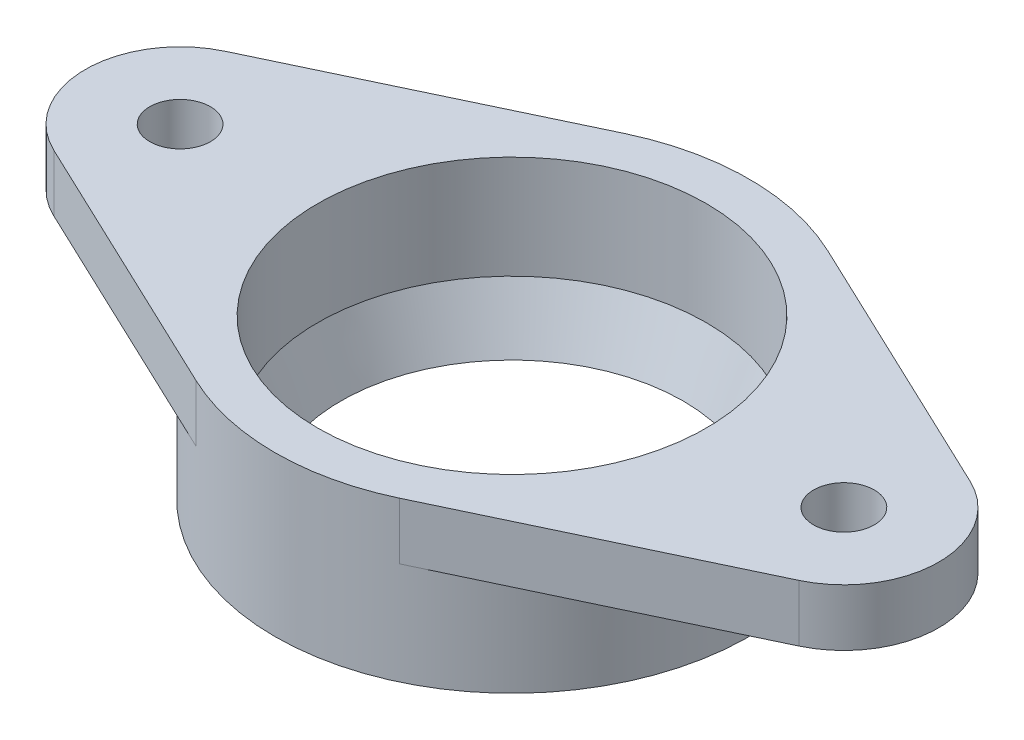
ISO-10303-21;
HEADER;
FILE_DESCRIPTION(('STEP AP214'),'2;1');
FILE_NAME('part.step','',(''),(''),'','','');
FILE_SCHEMA(('AUTOMOTIVE_DESIGN { 1 0 10303 214 1 1 1 1 }'));
ENDSEC;
DATA;
#1=APPLICATION_CONTEXT('core data for automotive mechanical design processes');
#2=APPLICATION_PROTOCOL_DEFINITION('international standard','automotive_design',2000,#1);
#3=PRODUCT_CONTEXT('',#1,'mechanical');
#4=PRODUCT('Part','Part','',(#3));
#5=PRODUCT_RELATED_PRODUCT_CATEGORY('part','',(#4));
#6=PRODUCT_DEFINITION_FORMATION('','',#4);
#7=PRODUCT_DEFINITION_CONTEXT('part definition',#1,'design');
#8=PRODUCT_DEFINITION('design','',#6,#7);
#9=PRODUCT_DEFINITION_SHAPE('','',#8);
#10=(LENGTH_UNIT() NAMED_UNIT(*) SI_UNIT(.MILLI.,.METRE.));
#11=(NAMED_UNIT(*) PLANE_ANGLE_UNIT() SI_UNIT($,.RADIAN.));
#12=(NAMED_UNIT(*) SI_UNIT($,.STERADIAN.) SOLID_ANGLE_UNIT());
#13=UNCERTAINTY_MEASURE_WITH_UNIT(LENGTH_MEASURE(1.E-05),#10,'distance_accuracy_value','');
#14=(GEOMETRIC_REPRESENTATION_CONTEXT(3) GLOBAL_UNCERTAINTY_ASSIGNED_CONTEXT((#13)) GLOBAL_UNIT_ASSIGNED_CONTEXT((#10,
#11,#12)) REPRESENTATION_CONTEXT('',''));
#15=CARTESIAN_POINT('',(0.,0.,0.));
#16=DIRECTION('',(0.,0.,1.));
#17=DIRECTION('',(1.,0.,0.));
#18=AXIS2_PLACEMENT_3D('',#15,#16,#17);
#19=CARTESIAN_POINT('',(0.,-8.4,0.));
#20=DIRECTION('',(0.,1.,0.));
#21=DIRECTION('',(0.,0.,1.));
#22=AXIS2_PLACEMENT_3D('',#19,#20,#21);
#23=CYLINDRICAL_SURFACE('',#22,12.5);
#24=CARTESIAN_POINT('',(0.,-8.4,0.));
#25=DIRECTION('',(0.,1.,0.));
#26=DIRECTION('',(0.,0.,1.));
#27=AXIS2_PLACEMENT_3D('',#24,#25,#26);
#28=CIRCLE('',#27,12.5);
#29=CARTESIAN_POINT('',(0.,-8.4,12.5));
#30=VERTEX_POINT('',#29);
#31=EDGE_CURVE('E11',#30,#30,#28,.T.);
#32=ORIENTED_EDGE('',*,*,#31,.T.);
#33=EDGE_LOOP('',(#32));
#34=FACE_BOUND('',#33,.T.);
#35=CARTESIAN_POINT('',(0.,0.,0.));
#36=DIRECTION('',(0.,1.,0.));
#37=DIRECTION('',(0.,0.,1.));
#38=AXIS2_PLACEMENT_3D('',#35,#36,#37);
#39=CIRCLE('',#38,12.5);
#40=CARTESIAN_POINT('',(5.35714285714285,0.,-11.2938487863156));
#41=VERTEX_POINT('',#40);
#42=CARTESIAN_POINT('',(-5.35714285714285,0.,-11.2938487863156));
#43=VERTEX_POINT('',#42);
#44=EDGE_CURVE('E184',#41,#43,#39,.T.);
#45=ORIENTED_EDGE('',*,*,#44,.F.);
#46=DIRECTION('',(0.,1.,0.));
#47=VECTOR('',#46,1.);
#48=CARTESIAN_POINT('',(5.35714285714285,-3.,-11.2938487863156));
#49=LINE('',#48,#47);
#50=CARTESIAN_POINT('',(5.35714285714285,-3.,-11.2938487863156));
#51=VERTEX_POINT('',#50);
#52=EDGE_CURVE('E129',#51,#41,#49,.T.);
#53=ORIENTED_EDGE('',*,*,#52,.F.);
#54=CARTESIAN_POINT('',(0.,-3.,0.));
#55=DIRECTION('',(0.,-1.,0.));
#56=DIRECTION('',(0.,0.,1.));
#57=AXIS2_PLACEMENT_3D('',#54,#55,#56);
#58=CIRCLE('',#57,12.5);
#59=CARTESIAN_POINT('',(5.35714285714285,-3.,11.2938487863156));
#60=VERTEX_POINT('',#59);
#61=EDGE_CURVE('E122',#51,#60,#58,.T.);
#62=ORIENTED_EDGE('',*,*,#61,.T.);
#63=DIRECTION('',(0.,1.,0.));
#64=VECTOR('',#63,1.);
#65=CARTESIAN_POINT('',(5.35714285714285,-3.,11.2938487863156));
#66=LINE('',#65,#64);
#67=CARTESIAN_POINT('',(5.35714285714285,0.,11.2938487863156));
#68=VERTEX_POINT('',#67);
#69=EDGE_CURVE('E106',#60,#68,#66,.T.);
#70=ORIENTED_EDGE('',*,*,#69,.T.);
#71=CARTESIAN_POINT('',(-5.35714285714285,0.,11.2938487863156));
#72=VERTEX_POINT('',#71);
#73=EDGE_CURVE('E46',#72,#68,#39,.T.);
#74=ORIENTED_EDGE('',*,*,#73,.F.);
#75=DIRECTION('',(0.,1.,0.));
#76=VECTOR('',#75,1.);
#77=CARTESIAN_POINT('',(-5.35714285714285,-3.,11.2938487863156));
#78=LINE('',#77,#76);
#79=CARTESIAN_POINT('',(-5.35714285714285,-3.,11.2938487863156));
#80=VERTEX_POINT('',#79);
#81=EDGE_CURVE('E171',#80,#72,#78,.T.);
#82=ORIENTED_EDGE('',*,*,#81,.F.);
#83=CARTESIAN_POINT('',(0.,-3.,0.));
#84=DIRECTION('',(0.,-1.,0.));
#85=DIRECTION('',(0.,0.,1.));
#86=AXIS2_PLACEMENT_3D('',#83,#84,#85);
#87=CIRCLE('',#86,12.5);
#88=CARTESIAN_POINT('',(-5.35714285714285,-3.,-11.2938487863156));
#89=VERTEX_POINT('',#88);
#90=EDGE_CURVE('E153',#80,#89,#87,.T.);
#91=ORIENTED_EDGE('',*,*,#90,.T.);
#92=DIRECTION('',(0.,1.,0.));
#93=VECTOR('',#92,1.);
#94=CARTESIAN_POINT('',(-5.35714285714285,-3.,-11.2938487863156));
#95=LINE('',#94,#93);
#96=EDGE_CURVE('E165',#89,#43,#95,.T.);
#97=ORIENTED_EDGE('',*,*,#96,.T.);
#98=EDGE_LOOP('',(#45,#53,#62,#70,#74,#82,#91,#97));
#99=FACE_BOUND('',#98,.T.);
#100=ADVANCED_FACE('F38',(#34,#99),#23,.T.);
#101=CARTESIAN_POINT('',(0.,-8.4,0.));
#102=DIRECTION('',(0.,1.,0.));
#103=DIRECTION('',(0.,0.,1.));
#104=AXIS2_PLACEMENT_3D('',#101,#102,#103);
#105=PLANE('',#104);
#106=ORIENTED_EDGE('',*,*,#31,.F.);
#107=EDGE_LOOP('',(#106));
#108=FACE_BOUND('',#107,.T.);
#109=CARTESIAN_POINT('',(0.,-8.4,0.));
#110=DIRECTION('',(0.,-1.,0.));
#111=DIRECTION('',(0.,0.,-1.));
#112=AXIS2_PLACEMENT_3D('',#109,#110,#111);
#113=CIRCLE('',#112,9.02387175054684);
#114=CARTESIAN_POINT('',(0.,-8.4,-9.02387175054684));
#115=VERTEX_POINT('',#114);
#116=EDGE_CURVE('E173',#115,#115,#113,.T.);
#117=ORIENTED_EDGE('',*,*,#116,.F.);
#118=EDGE_LOOP('',(#117));
#119=FACE_BOUND('',#118,.T.);
#120=ADVANCED_FACE('F211',(#108,#119),#105,.F.);
#121=CARTESIAN_POINT('',(0.,0.,0.));
#122=DIRECTION('',(0.,1.,0.));
#123=DIRECTION('',(0.,0.,1.));
#124=AXIS2_PLACEMENT_3D('',#121,#122,#123);
#125=PLANE('',#124);
#126=CARTESIAN_POINT('',(0.,0.,0.));
#127=DIRECTION('',(0.,-1.,0.));
#128=DIRECTION('',(0.,0.,-1.));
#129=AXIS2_PLACEMENT_3D('',#126,#127,#128);
#130=CIRCLE('',#129,10.25);
#131=CARTESIAN_POINT('',(0.,0.,-10.25));
#132=VERTEX_POINT('',#131);
#133=EDGE_CURVE('E182',#132,#132,#130,.T.);
#134=ORIENTED_EDGE('',*,*,#133,.T.);
#135=EDGE_LOOP('',(#134));
#136=FACE_BOUND('',#135,.T.);
#137=ORIENTED_EDGE('',*,*,#73,.T.);
#138=DIRECTION('',(0.903507902905252,0.,-0.428571428571428));
#139=VECTOR('',#138,1.);
#140=CARTESIAN_POINT('',(5.35714285714285,0.,11.2938487863156));
#141=LINE('',#140,#139);
#142=CARTESIAN_POINT('',(19.6428571428571,0.,4.51753951452626));
#143=VERTEX_POINT('',#142);
#144=EDGE_CURVE('E111',#68,#143,#141,.T.);
#145=ORIENTED_EDGE('',*,*,#144,.T.);
#146=CARTESIAN_POINT('',(17.5,0.,0.));
#147=DIRECTION('',(0.,1.,0.));
#148=DIRECTION('',(0.,0.,-1.));
#149=AXIS2_PLACEMENT_3D('',#146,#147,#148);
#150=CIRCLE('',#149,5.);
#151=CARTESIAN_POINT('',(19.6428571428571,0.,-4.51753951452626));
#152=VERTEX_POINT('',#151);
#153=EDGE_CURVE('E131',#143,#152,#150,.T.);
#154=ORIENTED_EDGE('',*,*,#153,.T.);
#155=DIRECTION('',(-0.903507902905252,0.,-0.428571428571428));
#156=VECTOR('',#155,1.);
#157=CARTESIAN_POINT('',(5.35714285714285,0.,-11.2938487863156));
#158=LINE('',#157,#156);
#159=EDGE_CURVE('E54',#152,#41,#158,.T.);
#160=ORIENTED_EDGE('',*,*,#159,.T.);
#161=ORIENTED_EDGE('',*,*,#44,.T.);
#162=DIRECTION('',(-0.903507902905252,0.,0.428571428571428));
#163=VECTOR('',#162,1.);
#164=CARTESIAN_POINT('',(-5.35714285714285,0.,-11.2938487863156));
#165=LINE('',#164,#163);
#166=CARTESIAN_POINT('',(-19.6428571428571,0.,-4.51753951452626));
#167=VERTEX_POINT('',#166);
#168=EDGE_CURVE('E150',#43,#167,#165,.T.);
#169=ORIENTED_EDGE('',*,*,#168,.T.);
#170=CARTESIAN_POINT('',(-17.5,0.,0.));
#171=DIRECTION('',(0.,1.,0.));
#172=DIRECTION('',(0.,0.,1.));
#173=AXIS2_PLACEMENT_3D('',#170,#171,#172);
#174=CIRCLE('',#173,5.);
#175=CARTESIAN_POINT('',(-19.6428571428571,0.,4.51753951452626));
#176=VERTEX_POINT('',#175);
#177=EDGE_CURVE('E168',#167,#176,#174,.T.);
#178=ORIENTED_EDGE('',*,*,#177,.T.);
#179=DIRECTION('',(0.903507902905252,0.,0.428571428571428));
#180=VECTOR('',#179,1.);
#181=CARTESIAN_POINT('',(-5.35714285714285,0.,11.2938487863156));
#182=LINE('',#181,#180);
#183=EDGE_CURVE('E61',#176,#72,#182,.T.);
#184=ORIENTED_EDGE('',*,*,#183,.T.);
#185=EDGE_LOOP('',(#137,#145,#154,#160,#161,#169,#178,#184));
#186=FACE_BOUND('',#185,.T.);
#187=CARTESIAN_POINT('',(-17.5,0.,0.));
#188=DIRECTION('',(0.,1.,0.));
#189=DIRECTION('',(0.,0.,1.));
#190=AXIS2_PLACEMENT_3D('',#187,#188,#189);
#191=CIRCLE('',#190,1.6);
#192=CARTESIAN_POINT('',(-17.5,0.,1.6));
#193=VERTEX_POINT('',#192);
#194=EDGE_CURVE('E143',#193,#193,#191,.T.);
#195=ORIENTED_EDGE('',*,*,#194,.F.);
#196=EDGE_LOOP('',(#195));
#197=FACE_BOUND('',#196,.T.);
#198=CARTESIAN_POINT('',(17.5,0.,0.));
#199=DIRECTION('',(0.,1.,0.));
#200=DIRECTION('',(0.,0.,-1.));
#201=AXIS2_PLACEMENT_3D('',#198,#199,#200);
#202=CIRCLE('',#201,1.6);
#203=CARTESIAN_POINT('',(17.5,0.,-1.6));
#204=VERTEX_POINT('',#203);
#205=EDGE_CURVE('E134',#204,#204,#202,.T.);
#206=ORIENTED_EDGE('',*,*,#205,.F.);
#207=EDGE_LOOP('',(#206));
#208=FACE_BOUND('',#207,.T.);
#209=ADVANCED_FACE('F186',(#136,#186,#197,#208),#125,.T.);
#210=CARTESIAN_POINT('',(0.,0.,0.));
#211=DIRECTION('',(0.,-1.,0.));
#212=DIRECTION('',(0.,0.,-1.));
#213=AXIS2_PLACEMENT_3D('',#210,#211,#212);
#214=CYLINDRICAL_SURFACE('',#213,10.25);
#215=CARTESIAN_POINT('',(0.,-5.43708362974617,0.));
#216=DIRECTION('',(0.,1.,0.));
#217=DIRECTION('',(0.,0.,1.));
#218=AXIS2_PLACEMENT_3D('',#215,#216,#217);
#219=CIRCLE('',#218,10.25);
#220=CARTESIAN_POINT('',(0.,-5.43708362974617,10.25));
#221=VERTEX_POINT('',#220);
#222=EDGE_CURVE('E41',#221,#221,#219,.F.);
#223=ORIENTED_EDGE('',*,*,#222,.T.);
#224=EDGE_LOOP('',(#223));
#225=FACE_BOUND('',#224,.T.);
#226=ORIENTED_EDGE('',*,*,#133,.F.);
#227=EDGE_LOOP('',(#226));
#228=FACE_BOUND('',#227,.T.);
#229=ADVANCED_FACE('F224',(#225,#228),#214,.F.);
#230=CARTESIAN_POINT('',(0.,0.,0.));
#231=DIRECTION('',(0.,1.,0.));
#232=DIRECTION('',(0.,0.,1.));
#233=AXIS2_PLACEMENT_3D('',#230,#231,#232);
#234=CONICAL_SURFACE('',#233,12.5,0.392367199483089);
#235=ORIENTED_EDGE('',*,*,#116,.T.);
#236=EDGE_LOOP('',(#235));
#237=FACE_BOUND('',#236,.T.);
#238=ORIENTED_EDGE('',*,*,#222,.F.);
#239=EDGE_LOOP('',(#238));
#240=FACE_BOUND('',#239,.T.);
#241=ADVANCED_FACE('F208',(#237,#240),#234,.F.);
#242=CARTESIAN_POINT('',(-5.35714285714285,-3.,11.2938487863156));
#243=DIRECTION('',(-0.428571428571428,0.,0.903507902905251));
#244=DIRECTION('',(0.903507902905251,0.,0.428571428571428));
#245=AXIS2_PLACEMENT_3D('',#242,#243,#244);
#246=PLANE('',#245);
#247=ORIENTED_EDGE('',*,*,#183,.F.);
#248=DIRECTION('',(0.,1.,0.));
#249=VECTOR('',#248,1.);
#250=CARTESIAN_POINT('',(-19.6428571428571,-3.,4.51753951452626));
#251=LINE('',#250,#249);
#252=CARTESIAN_POINT('',(-19.6428571428571,-3.,4.51753951452626));
#253=VERTEX_POINT('',#252);
#254=EDGE_CURVE('E174',#253,#176,#251,.T.);
#255=ORIENTED_EDGE('',*,*,#254,.F.);
#256=DIRECTION('',(0.903507902905252,0.,0.428571428571428));
#257=VECTOR('',#256,1.);
#258=CARTESIAN_POINT('',(-5.35714285714285,-3.,11.2938487863156));
#259=LINE('',#258,#257);
#260=EDGE_CURVE('E162',#253,#80,#259,.T.);
#261=ORIENTED_EDGE('',*,*,#260,.T.);
#262=ORIENTED_EDGE('',*,*,#81,.T.);
#263=EDGE_LOOP('',(#247,#255,#261,#262));
#264=FACE_BOUND('',#263,.T.);
#265=ADVANCED_FACE('F198',(#264),#246,.T.);
#266=CARTESIAN_POINT('',(-17.5,-3.,0.));
#267=DIRECTION('',(0.,1.,0.));
#268=DIRECTION('',(0.,0.,1.));
#269=AXIS2_PLACEMENT_3D('',#266,#267,#268);
#270=CYLINDRICAL_SURFACE('',#269,5.);
#271=ORIENTED_EDGE('',*,*,#177,.F.);
#272=DIRECTION('',(0.,1.,0.));
#273=VECTOR('',#272,1.);
#274=CARTESIAN_POINT('',(-19.6428571428571,-3.,-4.51753951452626));
#275=LINE('',#274,#273);
#276=CARTESIAN_POINT('',(-19.6428571428571,-3.,-4.51753951452626));
#277=VERTEX_POINT('',#276);
#278=EDGE_CURVE('E176',#277,#167,#275,.T.);
#279=ORIENTED_EDGE('',*,*,#278,.F.);
#280=CARTESIAN_POINT('',(-17.5,-3.,0.));
#281=DIRECTION('',(0.,1.,0.));
#282=DIRECTION('',(0.,0.,1.));
#283=AXIS2_PLACEMENT_3D('',#280,#281,#282);
#284=CIRCLE('',#283,5.);
#285=EDGE_CURVE('E159',#277,#253,#284,.T.);
#286=ORIENTED_EDGE('',*,*,#285,.T.);
#287=ORIENTED_EDGE('',*,*,#254,.T.);
#288=EDGE_LOOP('',(#271,#279,#286,#287));
#289=FACE_BOUND('',#288,.T.);
#290=ADVANCED_FACE('F200',(#289),#270,.T.);
#291=CARTESIAN_POINT('',(-5.35714285714285,-3.,-11.2938487863156));
#292=DIRECTION('',(-0.428571428571428,0.,-0.903507902905251));
#293=DIRECTION('',(-0.903507902905251,0.,0.428571428571428));
#294=AXIS2_PLACEMENT_3D('',#291,#292,#293);
#295=PLANE('',#294);
#296=ORIENTED_EDGE('',*,*,#168,.F.);
#297=ORIENTED_EDGE('',*,*,#96,.F.);
#298=DIRECTION('',(-0.903507902905252,0.,0.428571428571428));
#299=VECTOR('',#298,1.);
#300=CARTESIAN_POINT('',(-5.35714285714285,-3.,-11.2938487863156));
#301=LINE('',#300,#299);
#302=EDGE_CURVE('E156',#89,#277,#301,.T.);
#303=ORIENTED_EDGE('',*,*,#302,.T.);
#304=ORIENTED_EDGE('',*,*,#278,.T.);
#305=EDGE_LOOP('',(#296,#297,#303,#304));
#306=FACE_BOUND('',#305,.T.);
#307=ADVANCED_FACE('F189',(#306),#295,.T.);
#308=CARTESIAN_POINT('',(0.,-3.,0.));
#309=DIRECTION('',(0.,1.,0.));
#310=DIRECTION('',(0.,0.,1.));
#311=AXIS2_PLACEMENT_3D('',#308,#309,#310);
#312=PLANE('',#311);
#313=CARTESIAN_POINT('',(-17.5,-3.,0.));
#314=DIRECTION('',(0.,1.,0.));
#315=DIRECTION('',(0.,0.,1.));
#316=AXIS2_PLACEMENT_3D('',#313,#314,#315);
#317=CIRCLE('',#316,1.6);
#318=CARTESIAN_POINT('',(-17.5,-3.,1.6));
#319=VERTEX_POINT('',#318);
#320=EDGE_CURVE('E147',#319,#319,#317,.T.);
#321=ORIENTED_EDGE('',*,*,#320,.T.);
#322=EDGE_LOOP('',(#321));
#323=FACE_BOUND('',#322,.T.);
#324=ORIENTED_EDGE('',*,*,#90,.F.);
#325=ORIENTED_EDGE('',*,*,#260,.F.);
#326=ORIENTED_EDGE('',*,*,#285,.F.);
#327=ORIENTED_EDGE('',*,*,#302,.F.);
#328=EDGE_LOOP('',(#324,#325,#326,#327));
#329=FACE_BOUND('',#328,.T.);
#330=ADVANCED_FACE('F195',(#323,#329),#312,.F.);
#331=CARTESIAN_POINT('',(-17.5,-3.,0.));
#332=DIRECTION('',(0.,1.,0.));
#333=DIRECTION('',(0.,0.,1.));
#334=AXIS2_PLACEMENT_3D('',#331,#332,#333);
#335=CYLINDRICAL_SURFACE('',#334,1.6);
#336=ORIENTED_EDGE('',*,*,#320,.F.);
#337=EDGE_LOOP('',(#336));
#338=FACE_BOUND('',#337,.T.);
#339=ORIENTED_EDGE('',*,*,#194,.T.);
#340=EDGE_LOOP('',(#339));
#341=FACE_BOUND('',#340,.T.);
#342=ADVANCED_FACE('F270',(#338,#341),#335,.F.);
#343=CARTESIAN_POINT('',(5.35714285714285,-3.,-11.2938487863156));
#344=DIRECTION('',(0.428571428571428,0.,-0.903507902905251));
#345=DIRECTION('',(-0.903507902905251,0.,-0.428571428571428));
#346=AXIS2_PLACEMENT_3D('',#343,#344,#345);
#347=PLANE('',#346);
#348=ORIENTED_EDGE('',*,*,#159,.F.);
#349=DIRECTION('',(0.,1.,0.));
#350=VECTOR('',#349,1.);
#351=CARTESIAN_POINT('',(19.6428571428571,-3.,-4.51753951452626));
#352=LINE('',#351,#350);
#353=CARTESIAN_POINT('',(19.6428571428571,-3.,-4.51753951452626));
#354=VERTEX_POINT('',#353);
#355=EDGE_CURVE('E144',#354,#152,#352,.T.);
#356=ORIENTED_EDGE('',*,*,#355,.F.);
#357=DIRECTION('',(-0.903507902905252,0.,-0.428571428571428));
#358=VECTOR('',#357,1.);
#359=CARTESIAN_POINT('',(5.35714285714285,-3.,-11.2938487863156));
#360=LINE('',#359,#358);
#361=EDGE_CURVE('E116',#354,#51,#360,.T.);
#362=ORIENTED_EDGE('',*,*,#361,.T.);
#363=ORIENTED_EDGE('',*,*,#52,.T.);
#364=EDGE_LOOP('',(#348,#356,#362,#363));
#365=FACE_BOUND('',#364,.T.);
#366=ADVANCED_FACE('F280',(#365),#347,.T.);
#367=CARTESIAN_POINT('',(17.5,-3.,0.));
#368=DIRECTION('',(0.,1.,0.));
#369=DIRECTION('',(0.,0.,1.));
#370=AXIS2_PLACEMENT_3D('',#367,#368,#369);
#371=CYLINDRICAL_SURFACE('',#370,5.);
#372=ORIENTED_EDGE('',*,*,#153,.F.);
#373=DIRECTION('',(0.,1.,0.));
#374=VECTOR('',#373,1.);
#375=CARTESIAN_POINT('',(19.6428571428571,-3.,4.51753951452626));
#376=LINE('',#375,#374);
#377=CARTESIAN_POINT('',(19.6428571428571,-3.,4.51753951452626));
#378=VERTEX_POINT('',#377);
#379=EDGE_CURVE('E115',#378,#143,#376,.T.);
#380=ORIENTED_EDGE('',*,*,#379,.F.);
#381=CARTESIAN_POINT('',(17.5,-3.,0.));
#382=DIRECTION('',(0.,1.,0.));
#383=DIRECTION('',(0.,0.,-1.));
#384=AXIS2_PLACEMENT_3D('',#381,#382,#383);
#385=CIRCLE('',#384,5.);
#386=EDGE_CURVE('E125',#378,#354,#385,.T.);
#387=ORIENTED_EDGE('',*,*,#386,.T.);
#388=ORIENTED_EDGE('',*,*,#355,.T.);
#389=EDGE_LOOP('',(#372,#380,#387,#388));
#390=FACE_BOUND('',#389,.T.);
#391=ADVANCED_FACE('F290',(#390),#371,.T.);
#392=CARTESIAN_POINT('',(5.35714285714285,-3.,11.2938487863156));
#393=DIRECTION('',(0.428571428571428,0.,0.903507902905251));
#394=DIRECTION('',(0.903507902905251,0.,-0.428571428571428));
#395=AXIS2_PLACEMENT_3D('',#392,#393,#394);
#396=PLANE('',#395);
#397=ORIENTED_EDGE('',*,*,#144,.F.);
#398=ORIENTED_EDGE('',*,*,#69,.F.);
#399=DIRECTION('',(0.903507902905252,0.,-0.428571428571428));
#400=VECTOR('',#399,1.);
#401=CARTESIAN_POINT('',(5.35714285714285,-3.,11.2938487863156));
#402=LINE('',#401,#400);
#403=EDGE_CURVE('E109',#60,#378,#402,.T.);
#404=ORIENTED_EDGE('',*,*,#403,.T.);
#405=ORIENTED_EDGE('',*,*,#379,.T.);
#406=EDGE_LOOP('',(#397,#398,#404,#405));
#407=FACE_BOUND('',#406,.T.);
#408=ADVANCED_FACE('F108',(#407),#396,.T.);
#409=CARTESIAN_POINT('',(0.,-3.,0.));
#410=DIRECTION('',(0.,1.,0.));
#411=DIRECTION('',(0.,0.,1.));
#412=AXIS2_PLACEMENT_3D('',#409,#410,#411);
#413=PLANE('',#412);
#414=CARTESIAN_POINT('',(17.5,-3.,0.));
#415=DIRECTION('',(0.,1.,0.));
#416=DIRECTION('',(0.,0.,-1.));
#417=AXIS2_PLACEMENT_3D('',#414,#415,#416);
#418=CIRCLE('',#417,1.6);
#419=CARTESIAN_POINT('',(17.5,-3.,-1.6));
#420=VERTEX_POINT('',#419);
#421=EDGE_CURVE('E140',#420,#420,#418,.T.);
#422=ORIENTED_EDGE('',*,*,#421,.T.);
#423=EDGE_LOOP('',(#422));
#424=FACE_BOUND('',#423,.T.);
#425=ORIENTED_EDGE('',*,*,#61,.F.);
#426=ORIENTED_EDGE('',*,*,#361,.F.);
#427=ORIENTED_EDGE('',*,*,#386,.F.);
#428=ORIENTED_EDGE('',*,*,#403,.F.);
#429=EDGE_LOOP('',(#425,#426,#427,#428));
#430=FACE_BOUND('',#429,.T.);
#431=ADVANCED_FACE('F120',(#424,#430),#413,.F.);
#432=CARTESIAN_POINT('',(17.5,-3.,0.));
#433=DIRECTION('',(0.,1.,0.));
#434=DIRECTION('',(0.,0.,1.));
#435=AXIS2_PLACEMENT_3D('',#432,#433,#434);
#436=CYLINDRICAL_SURFACE('',#435,1.6);
#437=ORIENTED_EDGE('',*,*,#421,.F.);
#438=EDGE_LOOP('',(#437));
#439=FACE_BOUND('',#438,.T.);
#440=ORIENTED_EDGE('',*,*,#205,.T.);
#441=EDGE_LOOP('',(#440));
#442=FACE_BOUND('',#441,.T.);
#443=ADVANCED_FACE('F317',(#439,#442),#436,.F.);
#444=CLOSED_SHELL('',(#100,#120,#209,#229,#241,#265,#290,#307,#330,#342,#366,#391,#408,#431,#443));
#445=MANIFOLD_SOLID_BREP('B2',#444);
#446=ADVANCED_BREP_SHAPE_REPRESENTATION('',(#18,#445),#14);
#447=SHAPE_DEFINITION_REPRESENTATION(#9,#446);
ENDSEC;
END-ISO-10303-21;
